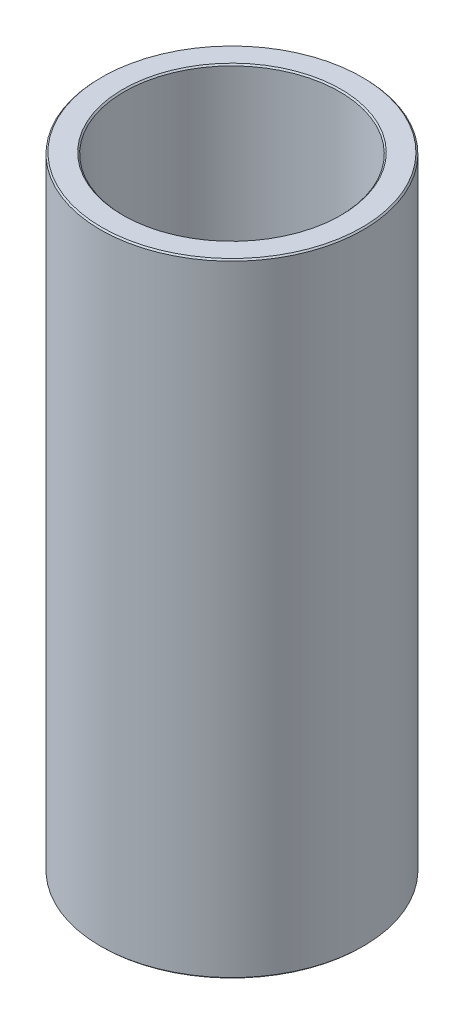
ISO-10303-21;
HEADER;
FILE_DESCRIPTION(('STEP AP214'),'2;1');
FILE_NAME('part.step','',(''),(''),'','','');
FILE_SCHEMA(('AUTOMOTIVE_DESIGN { 1 0 10303 214 1 1 1 1 }'));
ENDSEC;
DATA;
#1=APPLICATION_CONTEXT('core data for automotive mechanical design processes');
#2=APPLICATION_PROTOCOL_DEFINITION('international standard','automotive_design',2000,#1);
#3=PRODUCT_CONTEXT('',#1,'mechanical');
#4=PRODUCT('Part','Part','',(#3));
#5=PRODUCT_RELATED_PRODUCT_CATEGORY('part','',(#4));
#6=PRODUCT_DEFINITION_FORMATION('','',#4);
#7=PRODUCT_DEFINITION_CONTEXT('part definition',#1,'design');
#8=PRODUCT_DEFINITION('design','',#6,#7);
#9=PRODUCT_DEFINITION_SHAPE('','',#8);
#10=(LENGTH_UNIT() NAMED_UNIT(*) SI_UNIT(.MILLI.,.METRE.));
#11=(NAMED_UNIT(*) PLANE_ANGLE_UNIT() SI_UNIT($,.RADIAN.));
#12=(NAMED_UNIT(*) SI_UNIT($,.STERADIAN.) SOLID_ANGLE_UNIT());
#13=UNCERTAINTY_MEASURE_WITH_UNIT(LENGTH_MEASURE(1.E-05),#10,'distance_accuracy_value','');
#14=(GEOMETRIC_REPRESENTATION_CONTEXT(3) GLOBAL_UNCERTAINTY_ASSIGNED_CONTEXT((#13)) GLOBAL_UNIT_ASSIGNED_CONTEXT((#10,
#11,#12)) REPRESENTATION_CONTEXT('',''));
#15=CARTESIAN_POINT('',(0.,0.,0.));
#16=DIRECTION('',(0.,0.,1.));
#17=DIRECTION('',(1.,0.,0.));
#18=AXIS2_PLACEMENT_3D('',#15,#16,#17);
#19=CARTESIAN_POINT('',(0.,260.625235347049,0.));
#20=DIRECTION('',(0.,-1.,0.));
#21=DIRECTION('',(0.,0.,-1.));
#22=AXIS2_PLACEMENT_3D('',#19,#20,#21);
#23=CYLINDRICAL_SURFACE('',#22,55.);
#24=CARTESIAN_POINT('',(0.,0.577051638396164,0.));
#25=DIRECTION('',(0.,1.,0.));
#26=DIRECTION('',(0.,0.,1.));
#27=AXIS2_PLACEMENT_3D('',#24,#25,#26);
#28=CIRCLE('',#27,55.);
#29=CARTESIAN_POINT('',(0.,0.577051638396164,55.));
#30=VERTEX_POINT('',#29);
#31=EDGE_CURVE('E10',#30,#30,#28,.T.);
#32=ORIENTED_EDGE('',*,*,#31,.T.);
#33=EDGE_LOOP('',(#32));
#34=FACE_BOUND('',#33,.T.);
#35=CARTESIAN_POINT('',(0.,260.041149021671,0.));
#36=DIRECTION('',(0.,1.,0.));
#37=DIRECTION('',(0.,0.,1.));
#38=AXIS2_PLACEMENT_3D('',#35,#36,#37);
#39=CIRCLE('',#38,55.);
#40=CARTESIAN_POINT('',(0.,260.041149021671,55.));
#41=VERTEX_POINT('',#40);
#42=EDGE_CURVE('E50',#41,#41,#39,.F.);
#43=ORIENTED_EDGE('',*,*,#42,.T.);
#44=EDGE_LOOP('',(#43));
#45=FACE_BOUND('',#44,.T.);
#46=ADVANCED_FACE('F39',(#34,#45),#23,.T.);
#47=CARTESIAN_POINT('',(0.,260.625235347049,0.));
#48=DIRECTION('',(0.,1.,0.));
#49=DIRECTION('',(0.,0.,1.));
#50=AXIS2_PLACEMENT_3D('',#47,#48,#49);
#51=PLANE('',#50);
#52=CARTESIAN_POINT('',(0.,260.625235347049,0.));
#53=DIRECTION('',(0.,1.,0.));
#54=DIRECTION('',(0.,0.,1.));
#55=AXIS2_PLACEMENT_3D('',#52,#53,#54);
#56=CIRCLE('',#55,45.6392899253345);
#57=CARTESIAN_POINT('',(0.,260.625235347049,45.6392899253345));
#58=VERTEX_POINT('',#57);
#59=EDGE_CURVE('E58',#58,#58,#56,.F.);
#60=ORIENTED_EDGE('',*,*,#59,.T.);
#61=EDGE_LOOP('',(#60));
#62=FACE_BOUND('',#61,.T.);
#63=CARTESIAN_POINT('',(0.,260.625235347049,0.));
#64=DIRECTION('',(0.,1.,0.));
#65=DIRECTION('',(0.,0.,1.));
#66=AXIS2_PLACEMENT_3D('',#63,#64,#65);
#67=CIRCLE('',#66,54.4229483616038);
#68=CARTESIAN_POINT('',(0.,260.625235347049,54.4229483616038));
#69=VERTEX_POINT('',#68);
#70=EDGE_CURVE('E61',#69,#69,#67,.T.);
#71=ORIENTED_EDGE('',*,*,#70,.T.);
#72=EDGE_LOOP('',(#71));
#73=FACE_BOUND('',#72,.T.);
#74=ADVANCED_FACE('F88',(#62,#73),#51,.T.);
#75=CARTESIAN_POINT('',(0.,0.,0.));
#76=DIRECTION('',(0.,1.,0.));
#77=DIRECTION('',(0.,0.,1.));
#78=AXIS2_PLACEMENT_3D('',#75,#76,#77);
#79=PLANE('',#78);
#80=CARTESIAN_POINT('',(0.,0.,0.));
#81=DIRECTION('',(0.,1.,0.));
#82=DIRECTION('',(0.,0.,1.));
#83=AXIS2_PLACEMENT_3D('',#80,#81,#82);
#84=CIRCLE('',#83,45.632255238352);
#85=CARTESIAN_POINT('',(0.,0.,45.632255238352));
#86=VERTEX_POINT('',#85);
#87=EDGE_CURVE('E51',#86,#86,#84,.T.);
#88=ORIENTED_EDGE('',*,*,#87,.T.);
#89=EDGE_LOOP('',(#88));
#90=FACE_BOUND('',#89,.T.);
#91=CARTESIAN_POINT('',(0.,0.,0.));
#92=DIRECTION('',(0.,1.,0.));
#93=DIRECTION('',(0.,0.,1.));
#94=AXIS2_PLACEMENT_3D('',#91,#92,#93);
#95=CIRCLE('',#94,54.4159136746212);
#96=CARTESIAN_POINT('',(0.,0.,54.4159136746212));
#97=VERTEX_POINT('',#96);
#98=EDGE_CURVE('E54',#97,#97,#95,.F.);
#99=ORIENTED_EDGE('',*,*,#98,.T.);
#100=EDGE_LOOP('',(#99));
#101=FACE_BOUND('',#100,.T.);
#102=ADVANCED_FACE('F83',(#90,#101),#79,.F.);
#103=CARTESIAN_POINT('',(0.,260.625235347049,0.));
#104=DIRECTION('',(0.,-1.,0.));
#105=DIRECTION('',(0.,0.,-1.));
#106=AXIS2_PLACEMENT_3D('',#103,#104,#105);
#107=CYLINDRICAL_SURFACE('',#106,45.0552035999558);
#108=CARTESIAN_POINT('',(0.,260.048183708653,0.));
#109=DIRECTION('',(0.,1.,0.));
#110=DIRECTION('',(0.,0.,1.));
#111=AXIS2_PLACEMENT_3D('',#108,#109,#110);
#112=CIRCLE('',#111,45.0552035999558);
#113=CARTESIAN_POINT('',(0.,260.048183708653,45.0552035999558));
#114=VERTEX_POINT('',#113);
#115=EDGE_CURVE('E67',#114,#114,#112,.T.);
#116=ORIENTED_EDGE('',*,*,#115,.T.);
#117=EDGE_LOOP('',(#116));
#118=FACE_BOUND('',#117,.T.);
#119=CARTESIAN_POINT('',(0.,0.584086325378819,0.));
#120=DIRECTION('',(0.,1.,0.));
#121=DIRECTION('',(0.,0.,1.));
#122=AXIS2_PLACEMENT_3D('',#119,#120,#121);
#123=CIRCLE('',#122,45.0552035999558);
#124=CARTESIAN_POINT('',(0.,0.584086325378819,45.0552035999558));
#125=VERTEX_POINT('',#124);
#126=EDGE_CURVE('E69',#125,#125,#123,.F.);
#127=ORIENTED_EDGE('',*,*,#126,.T.);
#128=EDGE_LOOP('',(#127));
#129=FACE_BOUND('',#128,.T.);
#130=ADVANCED_FACE('F71',(#118,#129),#107,.F.);
#131=CARTESIAN_POINT('',(0.,260.048183708653,0.));
#132=DIRECTION('',(0.,1.,0.));
#133=DIRECTION('',(0.,0.,1.));
#134=AXIS2_PLACEMENT_3D('',#131,#132,#133);
#135=CONICAL_SURFACE('',#134,45.0552035999558,0.791456531253141);
#136=ORIENTED_EDGE('',*,*,#59,.F.);
#137=EDGE_LOOP('',(#136));
#138=FACE_BOUND('',#137,.T.);
#139=ORIENTED_EDGE('',*,*,#115,.F.);
#140=EDGE_LOOP('',(#139));
#141=FACE_BOUND('',#140,.T.);
#142=ADVANCED_FACE('F77',(#138,#141),#135,.F.);
#143=CARTESIAN_POINT('',(0.,0.,0.));
#144=DIRECTION('',(0.,-1.,0.));
#145=DIRECTION('',(0.,0.,-1.));
#146=AXIS2_PLACEMENT_3D('',#143,#144,#145);
#147=CONICAL_SURFACE('',#146,45.632255238352,0.779339795541691);
#148=ORIENTED_EDGE('',*,*,#126,.F.);
#149=EDGE_LOOP('',(#148));
#150=FACE_BOUND('',#149,.T.);
#151=ORIENTED_EDGE('',*,*,#87,.F.);
#152=EDGE_LOOP('',(#151));
#153=FACE_BOUND('',#152,.T.);
#154=ADVANCED_FACE('F73',(#150,#153),#147,.F.);
#155=CARTESIAN_POINT('',(0.,0.577051638396164,0.));
#156=DIRECTION('',(0.,1.,0.));
#157=DIRECTION('',(0.,0.,1.));
#158=AXIS2_PLACEMENT_3D('',#155,#156,#157);
#159=CONICAL_SURFACE('',#158,55.,0.791456531253146);
#160=ORIENTED_EDGE('',*,*,#98,.F.);
#161=EDGE_LOOP('',(#160));
#162=FACE_BOUND('',#161,.T.);
#163=ORIENTED_EDGE('',*,*,#31,.F.);
#164=EDGE_LOOP('',(#163));
#165=FACE_BOUND('',#164,.T.);
#166=ADVANCED_FACE('F76',(#162,#165),#159,.T.);
#167=CARTESIAN_POINT('',(0.,260.625235347049,0.));
#168=DIRECTION('',(0.,-1.,0.));
#169=DIRECTION('',(0.,0.,-1.));
#170=AXIS2_PLACEMENT_3D('',#167,#168,#169);
#171=CONICAL_SURFACE('',#170,54.4229483616038,0.779339795541715);
#172=ORIENTED_EDGE('',*,*,#42,.F.);
#173=EDGE_LOOP('',(#172));
#174=FACE_BOUND('',#173,.T.);
#175=ORIENTED_EDGE('',*,*,#70,.F.);
#176=EDGE_LOOP('',(#175));
#177=FACE_BOUND('',#176,.T.);
#178=ADVANCED_FACE('F45',(#174,#177),#171,.T.);
#179=CLOSED_SHELL('',(#46,#74,#102,#130,#142,#154,#166,#178));
#180=MANIFOLD_SOLID_BREP('B2',#179);
#181=ADVANCED_BREP_SHAPE_REPRESENTATION('',(#18,#180),#14);
#182=SHAPE_DEFINITION_REPRESENTATION(#9,#181);
ENDSEC;
END-ISO-10303-21;
